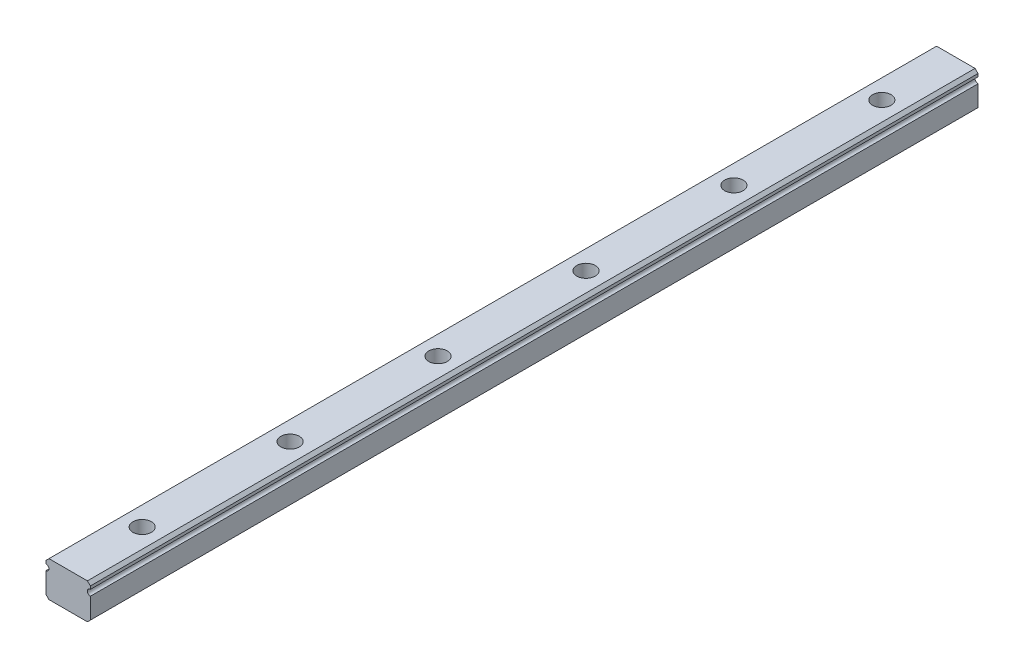
ISO-10303-21;
HEADER;
FILE_DESCRIPTION(('STEP AP214'),'2;1');
FILE_NAME('part.step','',(''),(''),'','','');
FILE_SCHEMA(('AUTOMOTIVE_DESIGN { 1 0 10303 214 1 1 1 1 }'));
ENDSEC;
DATA;
#1=APPLICATION_CONTEXT('core data for automotive mechanical design processes');
#2=APPLICATION_PROTOCOL_DEFINITION('international standard','automotive_design',2000,#1);
#3=PRODUCT_CONTEXT('',#1,'mechanical');
#4=PRODUCT('Part','Part','',(#3));
#5=PRODUCT_RELATED_PRODUCT_CATEGORY('part','',(#4));
#6=PRODUCT_DEFINITION_FORMATION('','',#4);
#7=PRODUCT_DEFINITION_CONTEXT('part definition',#1,'design');
#8=PRODUCT_DEFINITION('design','',#6,#7);
#9=PRODUCT_DEFINITION_SHAPE('','',#8);
#10=(LENGTH_UNIT() NAMED_UNIT(*) SI_UNIT(.MILLI.,.METRE.));
#11=(NAMED_UNIT(*) PLANE_ANGLE_UNIT() SI_UNIT($,.RADIAN.));
#12=(NAMED_UNIT(*) SI_UNIT($,.STERADIAN.) SOLID_ANGLE_UNIT());
#13=UNCERTAINTY_MEASURE_WITH_UNIT(LENGTH_MEASURE(1.E-05),#10,'distance_accuracy_value','');
#14=(GEOMETRIC_REPRESENTATION_CONTEXT(3) GLOBAL_UNCERTAINTY_ASSIGNED_CONTEXT((#13)) GLOBAL_UNIT_ASSIGNED_CONTEXT((#10,
#11,#12)) REPRESENTATION_CONTEXT('',''));
#15=CARTESIAN_POINT('',(0.,0.,0.));
#16=DIRECTION('',(0.,0.,1.));
#17=DIRECTION('',(1.,0.,0.));
#18=AXIS2_PLACEMENT_3D('',#15,#16,#17);
#19=CARTESIAN_POINT('',(0.,1.2,55.));
#20=DIRECTION('',(0.,1.,0.));
#21=DIRECTION('',(0.,0.,1.));
#22=AXIS2_PLACEMENT_3D('',#19,#20,#21);
#23=CYLINDRICAL_SURFACE('',#22,0.624999999999999);
#24=CARTESIAN_POINT('',(0.,-1.2,55.));
#25=DIRECTION('',(0.,1.,0.));
#26=DIRECTION('',(-1.,0.,0.));
#27=AXIS2_PLACEMENT_3D('',#24,#25,#26);
#28=CIRCLE('',#27,0.624999999999999);
#29=CARTESIAN_POINT('',(-0.624999999999999,-1.2,55.));
#30=VERTEX_POINT('',#29);
#31=EDGE_CURVE('E45',#30,#30,#28,.T.);
#32=ORIENTED_EDGE('',*,*,#31,.F.);
#33=EDGE_LOOP('',(#32));
#34=FACE_BOUND('',#33,.T.);
#35=CARTESIAN_POINT('',(0.,1.2,55.));
#36=DIRECTION('',(0.,1.,0.));
#37=DIRECTION('',(0.,0.,1.));
#38=AXIS2_PLACEMENT_3D('',#35,#36,#37);
#39=CIRCLE('',#38,0.624999999999998);
#40=CARTESIAN_POINT('',(0.,1.2,55.625));
#41=VERTEX_POINT('',#40);
#42=EDGE_CURVE('E11',#41,#41,#39,.T.);
#43=ORIENTED_EDGE('',*,*,#42,.T.);
#44=EDGE_LOOP('',(#43));
#45=FACE_BOUND('',#44,.T.);
#46=ADVANCED_FACE('F37',(#34,#45),#23,.F.);
#47=CARTESIAN_POINT('',(0.,1.2,45.));
#48=DIRECTION('',(0.,1.,0.));
#49=DIRECTION('',(0.,0.,1.));
#50=AXIS2_PLACEMENT_3D('',#47,#48,#49);
#51=CYLINDRICAL_SURFACE('',#50,0.624999999999999);
#52=CARTESIAN_POINT('',(0.,-1.2,45.));
#53=DIRECTION('',(0.,1.,0.));
#54=DIRECTION('',(-1.,0.,0.));
#55=AXIS2_PLACEMENT_3D('',#52,#53,#54);
#56=CIRCLE('',#55,0.624999999999999);
#57=CARTESIAN_POINT('',(-0.624999999999999,-1.2,45.));
#58=VERTEX_POINT('',#57);
#59=EDGE_CURVE('E221',#58,#58,#56,.T.);
#60=ORIENTED_EDGE('',*,*,#59,.F.);
#61=EDGE_LOOP('',(#60));
#62=FACE_BOUND('',#61,.T.);
#63=CARTESIAN_POINT('',(0.,1.2,45.));
#64=DIRECTION('',(0.,1.,0.));
#65=DIRECTION('',(0.,0.,1.));
#66=AXIS2_PLACEMENT_3D('',#63,#64,#65);
#67=CIRCLE('',#66,0.624999999999998);
#68=CARTESIAN_POINT('',(0.,1.2,45.625));
#69=VERTEX_POINT('',#68);
#70=EDGE_CURVE('E224',#69,#69,#67,.T.);
#71=ORIENTED_EDGE('',*,*,#70,.T.);
#72=EDGE_LOOP('',(#71));
#73=FACE_BOUND('',#72,.T.);
#74=ADVANCED_FACE('F233',(#62,#73),#51,.F.);
#75=CARTESIAN_POINT('',(0.,1.2,35.));
#76=DIRECTION('',(0.,1.,0.));
#77=DIRECTION('',(0.,0.,1.));
#78=AXIS2_PLACEMENT_3D('',#75,#76,#77);
#79=CYLINDRICAL_SURFACE('',#78,0.624999999999999);
#80=CARTESIAN_POINT('',(0.,-1.2,35.));
#81=DIRECTION('',(0.,1.,0.));
#82=DIRECTION('',(-1.,0.,0.));
#83=AXIS2_PLACEMENT_3D('',#80,#81,#82);
#84=CIRCLE('',#83,0.624999999999999);
#85=CARTESIAN_POINT('',(-0.624999999999999,-1.2,35.));
#86=VERTEX_POINT('',#85);
#87=EDGE_CURVE('E215',#86,#86,#84,.T.);
#88=ORIENTED_EDGE('',*,*,#87,.F.);
#89=EDGE_LOOP('',(#88));
#90=FACE_BOUND('',#89,.T.);
#91=CARTESIAN_POINT('',(0.,1.2,35.));
#92=DIRECTION('',(0.,1.,0.));
#93=DIRECTION('',(0.,0.,1.));
#94=AXIS2_PLACEMENT_3D('',#91,#92,#93);
#95=CIRCLE('',#94,0.624999999999998);
#96=CARTESIAN_POINT('',(0.,1.2,35.625));
#97=VERTEX_POINT('',#96);
#98=EDGE_CURVE('E218',#97,#97,#95,.T.);
#99=ORIENTED_EDGE('',*,*,#98,.T.);
#100=EDGE_LOOP('',(#99));
#101=FACE_BOUND('',#100,.T.);
#102=ADVANCED_FACE('F287',(#90,#101),#79,.F.);
#103=CARTESIAN_POINT('',(0.,1.2,25.));
#104=DIRECTION('',(0.,1.,0.));
#105=DIRECTION('',(0.,0.,1.));
#106=AXIS2_PLACEMENT_3D('',#103,#104,#105);
#107=CYLINDRICAL_SURFACE('',#106,0.624999999999999);
#108=CARTESIAN_POINT('',(0.,-1.2,25.));
#109=DIRECTION('',(0.,1.,0.));
#110=DIRECTION('',(-1.,0.,0.));
#111=AXIS2_PLACEMENT_3D('',#108,#109,#110);
#112=CIRCLE('',#111,0.624999999999999);
#113=CARTESIAN_POINT('',(-0.624999999999999,-1.2,25.));
#114=VERTEX_POINT('',#113);
#115=EDGE_CURVE('E209',#114,#114,#112,.T.);
#116=ORIENTED_EDGE('',*,*,#115,.F.);
#117=EDGE_LOOP('',(#116));
#118=FACE_BOUND('',#117,.T.);
#119=CARTESIAN_POINT('',(0.,1.2,25.));
#120=DIRECTION('',(0.,1.,0.));
#121=DIRECTION('',(0.,0.,1.));
#122=AXIS2_PLACEMENT_3D('',#119,#120,#121);
#123=CIRCLE('',#122,0.624999999999998);
#124=CARTESIAN_POINT('',(0.,1.2,25.625));
#125=VERTEX_POINT('',#124);
#126=EDGE_CURVE('E212',#125,#125,#123,.T.);
#127=ORIENTED_EDGE('',*,*,#126,.T.);
#128=EDGE_LOOP('',(#127));
#129=FACE_BOUND('',#128,.T.);
#130=ADVANCED_FACE('F283',(#118,#129),#107,.F.);
#131=CARTESIAN_POINT('',(-1.5,0.799999999999999,60.));
#132=DIRECTION('',(1.,0.,0.));
#133=DIRECTION('',(0.,1.,0.));
#134=AXIS2_PLACEMENT_3D('',#131,#132,#133);
#135=PLANE('',#134);
#136=DIRECTION('',(0.,-1.,0.));
#137=VECTOR('',#136,1.);
#138=CARTESIAN_POINT('',(-1.5,0.799999999999999,0.));
#139=LINE('',#138,#137);
#140=CARTESIAN_POINT('',(-1.5,0.999999999999999,0.));
#141=VERTEX_POINT('',#140);
#142=CARTESIAN_POINT('',(-1.5,0.799999999999999,0.));
#143=VERTEX_POINT('',#142);
#144=EDGE_CURVE('E159',#141,#143,#139,.T.);
#145=ORIENTED_EDGE('',*,*,#144,.T.);
#146=DIRECTION('',(0.,0.,-1.));
#147=VECTOR('',#146,1.);
#148=CARTESIAN_POINT('',(-1.5,0.799999999999999,60.));
#149=LINE('',#148,#147);
#150=CARTESIAN_POINT('',(-1.5,0.799999999999999,60.));
#151=VERTEX_POINT('',#150);
#152=EDGE_CURVE('E207',#151,#143,#149,.T.);
#153=ORIENTED_EDGE('',*,*,#152,.F.);
#154=DIRECTION('',(0.,-1.,0.));
#155=VECTOR('',#154,1.);
#156=CARTESIAN_POINT('',(-1.5,0.799999999999999,60.));
#157=LINE('',#156,#155);
#158=CARTESIAN_POINT('',(-1.5,0.999999999999999,60.));
#159=VERTEX_POINT('',#158);
#160=EDGE_CURVE('E182',#159,#151,#157,.T.);
#161=ORIENTED_EDGE('',*,*,#160,.F.);
#162=DIRECTION('',(0.,0.,-1.));
#163=VECTOR('',#162,1.);
#164=CARTESIAN_POINT('',(-1.5,0.999999999999999,60.));
#165=LINE('',#164,#163);
#166=EDGE_CURVE('E155',#159,#141,#165,.T.);
#167=ORIENTED_EDGE('',*,*,#166,.T.);
#168=EDGE_LOOP('',(#145,#153,#161,#167));
#169=FACE_BOUND('',#168,.T.);
#170=ADVANCED_FACE('F280',(#169),#135,.F.);
#171=CARTESIAN_POINT('',(-1.5,0.6,60.));
#172=DIRECTION('',(0.,0.,-1.));
#173=DIRECTION('',(-1.,0.,0.));
#174=AXIS2_PLACEMENT_3D('',#171,#172,#173);
#175=CYLINDRICAL_SURFACE('',#174,0.2);
#176=CARTESIAN_POINT('',(-1.5,0.6,0.));
#177=DIRECTION('',(0.,0.,-1.));
#178=DIRECTION('',(1.,0.,0.));
#179=AXIS2_PLACEMENT_3D('',#176,#177,#178);
#180=CIRCLE('',#179,0.2);
#181=CARTESIAN_POINT('',(-1.5,0.4,0.));
#182=VERTEX_POINT('',#181);
#183=EDGE_CURVE('E162',#143,#182,#180,.T.);
#184=ORIENTED_EDGE('',*,*,#183,.T.);
#185=DIRECTION('',(0.,0.,-1.));
#186=VECTOR('',#185,1.);
#187=CARTESIAN_POINT('',(-1.5,0.4,60.));
#188=LINE('',#187,#186);
#189=CARTESIAN_POINT('',(-1.5,0.4,60.));
#190=VERTEX_POINT('',#189);
#191=EDGE_CURVE('E204',#190,#182,#188,.T.);
#192=ORIENTED_EDGE('',*,*,#191,.F.);
#193=CARTESIAN_POINT('',(-1.5,0.6,60.));
#194=DIRECTION('',(0.,0.,-1.));
#195=DIRECTION('',(1.,0.,0.));
#196=AXIS2_PLACEMENT_3D('',#193,#194,#195);
#197=CIRCLE('',#196,0.2);
#198=EDGE_CURVE('E109',#151,#190,#197,.T.);
#199=ORIENTED_EDGE('',*,*,#198,.F.);
#200=ORIENTED_EDGE('',*,*,#152,.T.);
#201=EDGE_LOOP('',(#184,#192,#199,#200));
#202=FACE_BOUND('',#201,.T.);
#203=ADVANCED_FACE('F276',(#202),#175,.F.);
#204=CARTESIAN_POINT('',(-1.5,-1.,60.));
#205=DIRECTION('',(1.,0.,0.));
#206=DIRECTION('',(0.,0.,-1.));
#207=AXIS2_PLACEMENT_3D('',#204,#205,#206);
#208=PLANE('',#207);
#209=DIRECTION('',(0.,-1.,0.));
#210=VECTOR('',#209,1.);
#211=CARTESIAN_POINT('',(-1.5,-1.,0.));
#212=LINE('',#211,#210);
#213=CARTESIAN_POINT('',(-1.5,-1.,0.));
#214=VERTEX_POINT('',#213);
#215=EDGE_CURVE('E165',#182,#214,#212,.T.);
#216=ORIENTED_EDGE('',*,*,#215,.T.);
#217=DIRECTION('',(0.,0.,-1.));
#218=VECTOR('',#217,1.);
#219=CARTESIAN_POINT('',(-1.5,-1.,60.));
#220=LINE('',#219,#218);
#221=CARTESIAN_POINT('',(-1.5,-1.,60.));
#222=VERTEX_POINT('',#221);
#223=EDGE_CURVE('E201',#222,#214,#220,.T.);
#224=ORIENTED_EDGE('',*,*,#223,.F.);
#225=DIRECTION('',(0.,-1.,0.));
#226=VECTOR('',#225,1.);
#227=CARTESIAN_POINT('',(-1.5,-1.,60.));
#228=LINE('',#227,#226);
#229=EDGE_CURVE('E464',#190,#222,#228,.T.);
#230=ORIENTED_EDGE('',*,*,#229,.F.);
#231=ORIENTED_EDGE('',*,*,#191,.T.);
#232=EDGE_LOOP('',(#216,#224,#230,#231));
#233=FACE_BOUND('',#232,.T.);
#234=ADVANCED_FACE('F272',(#233),#208,.F.);
#235=CARTESIAN_POINT('',(-1.5,-1.,60.));
#236=DIRECTION('',(0.707106781186549,0.707106781186546,0.));
#237=DIRECTION('',(-0.707106781186546,0.707106781186549,0.));
#238=AXIS2_PLACEMENT_3D('',#235,#236,#237);
#239=PLANE('',#238);
#240=DIRECTION('',(0.707106781186546,-0.707106781186549,0.));
#241=VECTOR('',#240,1.);
#242=CARTESIAN_POINT('',(-1.5,-1.,0.));
#243=LINE('',#242,#241);
#244=CARTESIAN_POINT('',(-1.3,-1.2,0.));
#245=VERTEX_POINT('',#244);
#246=EDGE_CURVE('E167',#214,#245,#243,.T.);
#247=ORIENTED_EDGE('',*,*,#246,.T.);
#248=DIRECTION('',(0.,0.,-1.));
#249=VECTOR('',#248,1.);
#250=CARTESIAN_POINT('',(-1.3,-1.2,60.));
#251=LINE('',#250,#249);
#252=CARTESIAN_POINT('',(-1.3,-1.2,60.));
#253=VERTEX_POINT('',#252);
#254=EDGE_CURVE('E198',#253,#245,#251,.T.);
#255=ORIENTED_EDGE('',*,*,#254,.F.);
#256=DIRECTION('',(0.707106781186546,-0.707106781186549,0.));
#257=VECTOR('',#256,1.);
#258=CARTESIAN_POINT('',(-1.5,-1.,60.));
#259=LINE('',#258,#257);
#260=EDGE_CURVE('E466',#222,#253,#259,.T.);
#261=ORIENTED_EDGE('',*,*,#260,.F.);
#262=ORIENTED_EDGE('',*,*,#223,.T.);
#263=EDGE_LOOP('',(#247,#255,#261,#262));
#264=FACE_BOUND('',#263,.T.);
#265=ADVANCED_FACE('F268',(#264),#239,.F.);
#266=CARTESIAN_POINT('',(-1.3,-1.2,60.));
#267=DIRECTION('',(0.,1.,0.));
#268=DIRECTION('',(-1.,0.,0.));
#269=AXIS2_PLACEMENT_3D('',#266,#267,#268);
#270=PLANE('',#269);
#271=CARTESIAN_POINT('',(0.,-1.2,15.));
#272=DIRECTION('',(0.,1.,0.));
#273=DIRECTION('',(-1.,0.,0.));
#274=AXIS2_PLACEMENT_3D('',#271,#272,#273);
#275=CIRCLE('',#274,0.624999999999999);
#276=CARTESIAN_POINT('',(-0.624999999999999,-1.2,15.));
#277=VERTEX_POINT('',#276);
#278=EDGE_CURVE('E451',#277,#277,#275,.T.);
#279=ORIENTED_EDGE('',*,*,#278,.T.);
#280=EDGE_LOOP('',(#279));
#281=FACE_BOUND('',#280,.T.);
#282=CARTESIAN_POINT('',(0.,-1.2,5.));
#283=DIRECTION('',(0.,1.,0.));
#284=DIRECTION('',(-1.,0.,0.));
#285=AXIS2_PLACEMENT_3D('',#282,#283,#284);
#286=CIRCLE('',#285,0.624999999999999);
#287=CARTESIAN_POINT('',(-0.624999999999999,-1.2,5.));
#288=VERTEX_POINT('',#287);
#289=EDGE_CURVE('E163',#288,#288,#286,.T.);
#290=ORIENTED_EDGE('',*,*,#289,.T.);
#291=EDGE_LOOP('',(#290));
#292=FACE_BOUND('',#291,.T.);
#293=DIRECTION('',(1.,0.,0.));
#294=VECTOR('',#293,1.);
#295=CARTESIAN_POINT('',(-1.3,-1.2,0.));
#296=LINE('',#295,#294);
#297=CARTESIAN_POINT('',(1.3,-1.2,0.));
#298=VERTEX_POINT('',#297);
#299=EDGE_CURVE('E169',#245,#298,#296,.T.);
#300=ORIENTED_EDGE('',*,*,#299,.T.);
#301=DIRECTION('',(0.,0.,-1.));
#302=VECTOR('',#301,1.);
#303=CARTESIAN_POINT('',(1.3,-1.2,60.));
#304=LINE('',#303,#302);
#305=CARTESIAN_POINT('',(1.3,-1.2,60.));
#306=VERTEX_POINT('',#305);
#307=EDGE_CURVE('E195',#306,#298,#304,.T.);
#308=ORIENTED_EDGE('',*,*,#307,.F.);
#309=DIRECTION('',(1.,0.,0.));
#310=VECTOR('',#309,1.);
#311=CARTESIAN_POINT('',(-1.3,-1.2,60.));
#312=LINE('',#311,#310);
#313=EDGE_CURVE('E468',#253,#306,#312,.T.);
#314=ORIENTED_EDGE('',*,*,#313,.F.);
#315=ORIENTED_EDGE('',*,*,#254,.T.);
#316=EDGE_LOOP('',(#300,#308,#314,#315));
#317=FACE_BOUND('',#316,.T.);
#318=ORIENTED_EDGE('',*,*,#115,.T.);
#319=EDGE_LOOP('',(#318));
#320=FACE_BOUND('',#319,.T.);
#321=ORIENTED_EDGE('',*,*,#87,.T.);
#322=EDGE_LOOP('',(#321));
#323=FACE_BOUND('',#322,.T.);
#324=ORIENTED_EDGE('',*,*,#59,.T.);
#325=EDGE_LOOP('',(#324));
#326=FACE_BOUND('',#325,.T.);
#327=ORIENTED_EDGE('',*,*,#31,.T.);
#328=EDGE_LOOP('',(#327));
#329=FACE_BOUND('',#328,.T.);
#330=ADVANCED_FACE('F229',(#281,#292,#317,#320,#323,#326,#329),#270,.F.);
#331=CARTESIAN_POINT('',(1.5,-1.,60.));
#332=DIRECTION('',(-0.707106781186548,0.707106781186547,0.));
#333=DIRECTION('',(-0.707106781186547,-0.707106781186548,0.));
#334=AXIS2_PLACEMENT_3D('',#331,#332,#333);
#335=PLANE('',#334);
#336=DIRECTION('',(0.707106781186547,0.707106781186548,0.));
#337=VECTOR('',#336,1.);
#338=CARTESIAN_POINT('',(1.5,-1.,0.));
#339=LINE('',#338,#337);
#340=CARTESIAN_POINT('',(1.5,-1.,0.));
#341=VERTEX_POINT('',#340);
#342=EDGE_CURVE('E171',#298,#341,#339,.T.);
#343=ORIENTED_EDGE('',*,*,#342,.T.);
#344=DIRECTION('',(0.,0.,-1.));
#345=VECTOR('',#344,1.);
#346=CARTESIAN_POINT('',(1.5,-1.,60.));
#347=LINE('',#346,#345);
#348=CARTESIAN_POINT('',(1.5,-1.,60.));
#349=VERTEX_POINT('',#348);
#350=EDGE_CURVE('E192',#349,#341,#347,.T.);
#351=ORIENTED_EDGE('',*,*,#350,.F.);
#352=DIRECTION('',(0.707106781186547,0.707106781186548,0.));
#353=VECTOR('',#352,1.);
#354=CARTESIAN_POINT('',(1.5,-1.,60.));
#355=LINE('',#354,#353);
#356=EDGE_CURVE('E470',#306,#349,#355,.T.);
#357=ORIENTED_EDGE('',*,*,#356,.F.);
#358=ORIENTED_EDGE('',*,*,#307,.T.);
#359=EDGE_LOOP('',(#343,#351,#357,#358));
#360=FACE_BOUND('',#359,.T.);
#361=ADVANCED_FACE('F261',(#360),#335,.F.);
#362=CARTESIAN_POINT('',(1.5,-1.,60.));
#363=DIRECTION('',(-1.,0.,0.));
#364=DIRECTION('',(0.,0.,1.));
#365=AXIS2_PLACEMENT_3D('',#362,#363,#364);
#366=PLANE('',#365);
#367=DIRECTION('',(0.,1.,0.));
#368=VECTOR('',#367,1.);
#369=CARTESIAN_POINT('',(1.5,-1.,0.));
#370=LINE('',#369,#368);
#371=CARTESIAN_POINT('',(1.5,0.4,0.));
#372=VERTEX_POINT('',#371);
#373=EDGE_CURVE('E173',#341,#372,#370,.T.);
#374=ORIENTED_EDGE('',*,*,#373,.T.);
#375=DIRECTION('',(0.,0.,-1.));
#376=VECTOR('',#375,1.);
#377=CARTESIAN_POINT('',(1.5,0.4,60.));
#378=LINE('',#377,#376);
#379=CARTESIAN_POINT('',(1.5,0.4,60.));
#380=VERTEX_POINT('',#379);
#381=EDGE_CURVE('E189',#380,#372,#378,.T.);
#382=ORIENTED_EDGE('',*,*,#381,.F.);
#383=DIRECTION('',(0.,1.,0.));
#384=VECTOR('',#383,1.);
#385=CARTESIAN_POINT('',(1.5,-1.,60.));
#386=LINE('',#385,#384);
#387=EDGE_CURVE('E472',#349,#380,#386,.T.);
#388=ORIENTED_EDGE('',*,*,#387,.F.);
#389=ORIENTED_EDGE('',*,*,#350,.T.);
#390=EDGE_LOOP('',(#374,#382,#388,#389));
#391=FACE_BOUND('',#390,.T.);
#392=ADVANCED_FACE('F257',(#391),#366,.F.);
#393=CARTESIAN_POINT('',(1.5,0.6,60.));
#394=DIRECTION('',(0.,0.,-1.));
#395=DIRECTION('',(-1.,0.,0.));
#396=AXIS2_PLACEMENT_3D('',#393,#394,#395);
#397=CYLINDRICAL_SURFACE('',#396,0.2);
#398=CARTESIAN_POINT('',(1.5,0.6,0.));
#399=DIRECTION('',(0.,0.,-1.));
#400=DIRECTION('',(-1.,0.,0.));
#401=AXIS2_PLACEMENT_3D('',#398,#399,#400);
#402=CIRCLE('',#401,0.2);
#403=CARTESIAN_POINT('',(1.5,0.799999999999999,0.));
#404=VERTEX_POINT('',#403);
#405=EDGE_CURVE('E175',#372,#404,#402,.T.);
#406=ORIENTED_EDGE('',*,*,#405,.T.);
#407=DIRECTION('',(0.,0.,-1.));
#408=VECTOR('',#407,1.);
#409=CARTESIAN_POINT('',(1.5,0.799999999999999,60.));
#410=LINE('',#409,#408);
#411=CARTESIAN_POINT('',(1.5,0.799999999999999,60.));
#412=VERTEX_POINT('',#411);
#413=EDGE_CURVE('E186',#412,#404,#410,.T.);
#414=ORIENTED_EDGE('',*,*,#413,.F.);
#415=CARTESIAN_POINT('',(1.5,0.6,60.));
#416=DIRECTION('',(0.,0.,-1.));
#417=DIRECTION('',(-1.,0.,0.));
#418=AXIS2_PLACEMENT_3D('',#415,#416,#417);
#419=CIRCLE('',#418,0.2);
#420=EDGE_CURVE('E474',#380,#412,#419,.T.);
#421=ORIENTED_EDGE('',*,*,#420,.F.);
#422=ORIENTED_EDGE('',*,*,#381,.T.);
#423=EDGE_LOOP('',(#406,#414,#421,#422));
#424=FACE_BOUND('',#423,.T.);
#425=ADVANCED_FACE('F253',(#424),#397,.F.);
#426=CARTESIAN_POINT('',(1.5,0.799999999999999,60.));
#427=DIRECTION('',(-1.,0.,0.));
#428=DIRECTION('',(0.,-1.,0.));
#429=AXIS2_PLACEMENT_3D('',#426,#427,#428);
#430=PLANE('',#429);
#431=DIRECTION('',(0.,1.,0.));
#432=VECTOR('',#431,1.);
#433=CARTESIAN_POINT('',(1.5,0.799999999999999,0.));
#434=LINE('',#433,#432);
#435=CARTESIAN_POINT('',(1.5,1.,0.));
#436=VERTEX_POINT('',#435);
#437=EDGE_CURVE('E177',#404,#436,#434,.T.);
#438=ORIENTED_EDGE('',*,*,#437,.T.);
#439=DIRECTION('',(0.,0.,-1.));
#440=VECTOR('',#439,1.);
#441=CARTESIAN_POINT('',(1.5,1.,60.));
#442=LINE('',#441,#440);
#443=CARTESIAN_POINT('',(1.5,1.,60.));
#444=VERTEX_POINT('',#443);
#445=EDGE_CURVE('E149',#444,#436,#442,.T.);
#446=ORIENTED_EDGE('',*,*,#445,.F.);
#447=DIRECTION('',(0.,1.,0.));
#448=VECTOR('',#447,1.);
#449=CARTESIAN_POINT('',(1.5,0.799999999999999,60.));
#450=LINE('',#449,#448);
#451=EDGE_CURVE('E140',#412,#444,#450,.T.);
#452=ORIENTED_EDGE('',*,*,#451,.F.);
#453=ORIENTED_EDGE('',*,*,#413,.T.);
#454=EDGE_LOOP('',(#438,#446,#452,#453));
#455=FACE_BOUND('',#454,.T.);
#456=ADVANCED_FACE('F245',(#455),#430,.F.);
#457=CARTESIAN_POINT('',(1.5,1.,60.));
#458=DIRECTION('',(-0.707106781186548,-0.707106781186547,0.));
#459=DIRECTION('',(0.707106781186547,-0.707106781186548,0.));
#460=AXIS2_PLACEMENT_3D('',#457,#458,#459);
#461=PLANE('',#460);
#462=DIRECTION('',(-0.707106781186547,0.707106781186548,0.));
#463=VECTOR('',#462,1.);
#464=CARTESIAN_POINT('',(1.5,1.,0.));
#465=LINE('',#464,#463);
#466=CARTESIAN_POINT('',(1.3,1.2,0.));
#467=VERTEX_POINT('',#466);
#468=EDGE_CURVE('E148',#436,#467,#465,.T.);
#469=ORIENTED_EDGE('',*,*,#468,.T.);
#470=DIRECTION('',(0.,0.,-1.));
#471=VECTOR('',#470,1.);
#472=CARTESIAN_POINT('',(1.3,1.2,60.));
#473=LINE('',#472,#471);
#474=CARTESIAN_POINT('',(1.3,1.2,60.));
#475=VERTEX_POINT('',#474);
#476=EDGE_CURVE('E145',#475,#467,#473,.T.);
#477=ORIENTED_EDGE('',*,*,#476,.F.);
#478=DIRECTION('',(-0.707106781186547,0.707106781186548,0.));
#479=VECTOR('',#478,1.);
#480=CARTESIAN_POINT('',(1.5,1.,60.));
#481=LINE('',#480,#479);
#482=EDGE_CURVE('E134',#444,#475,#481,.T.);
#483=ORIENTED_EDGE('',*,*,#482,.F.);
#484=ORIENTED_EDGE('',*,*,#445,.T.);
#485=EDGE_LOOP('',(#469,#477,#483,#484));
#486=FACE_BOUND('',#485,.T.);
#487=ADVANCED_FACE('F146',(#486),#461,.F.);
#488=CARTESIAN_POINT('',(-1.3,1.2,60.));
#489=DIRECTION('',(0.,-1.,0.));
#490=DIRECTION('',(0.,0.,-1.));
#491=AXIS2_PLACEMENT_3D('',#488,#489,#490);
#492=PLANE('',#491);
#493=CARTESIAN_POINT('',(0.,1.2,15.));
#494=DIRECTION('',(0.,1.,0.));
#495=DIRECTION('',(0.,0.,1.));
#496=AXIS2_PLACEMENT_3D('',#493,#494,#495);
#497=CIRCLE('',#496,0.624999999999998);
#498=CARTESIAN_POINT('',(0.,1.2,15.625));
#499=VERTEX_POINT('',#498);
#500=EDGE_CURVE('E453',#499,#499,#497,.T.);
#501=ORIENTED_EDGE('',*,*,#500,.F.);
#502=EDGE_LOOP('',(#501));
#503=FACE_BOUND('',#502,.T.);
#504=CARTESIAN_POINT('',(0.,1.2,5.));
#505=DIRECTION('',(0.,1.,0.));
#506=DIRECTION('',(0.,0.,1.));
#507=AXIS2_PLACEMENT_3D('',#504,#505,#506);
#508=CIRCLE('',#507,0.624999999999998);
#509=CARTESIAN_POINT('',(0.,1.2,5.625));
#510=VERTEX_POINT('',#509);
#511=EDGE_CURVE('E454',#510,#510,#508,.T.);
#512=ORIENTED_EDGE('',*,*,#511,.F.);
#513=EDGE_LOOP('',(#512));
#514=FACE_BOUND('',#513,.T.);
#515=DIRECTION('',(-1.,0.,0.));
#516=VECTOR('',#515,1.);
#517=CARTESIAN_POINT('',(-1.3,1.2,0.));
#518=LINE('',#517,#516);
#519=CARTESIAN_POINT('',(-1.3,1.2,0.));
#520=VERTEX_POINT('',#519);
#521=EDGE_CURVE('E94',#467,#520,#518,.T.);
#522=ORIENTED_EDGE('',*,*,#521,.T.);
#523=DIRECTION('',(0.,0.,-1.));
#524=VECTOR('',#523,1.);
#525=CARTESIAN_POINT('',(-1.3,1.2,60.));
#526=LINE('',#525,#524);
#527=CARTESIAN_POINT('',(-1.3,1.2,60.));
#528=VERTEX_POINT('',#527);
#529=EDGE_CURVE('E150',#528,#520,#526,.T.);
#530=ORIENTED_EDGE('',*,*,#529,.F.);
#531=DIRECTION('',(-1.,0.,0.));
#532=VECTOR('',#531,1.);
#533=CARTESIAN_POINT('',(-1.3,1.2,60.));
#534=LINE('',#533,#532);
#535=EDGE_CURVE('E138',#475,#528,#534,.T.);
#536=ORIENTED_EDGE('',*,*,#535,.F.);
#537=ORIENTED_EDGE('',*,*,#476,.T.);
#538=EDGE_LOOP('',(#522,#530,#536,#537));
#539=FACE_BOUND('',#538,.T.);
#540=ORIENTED_EDGE('',*,*,#126,.F.);
#541=EDGE_LOOP('',(#540));
#542=FACE_BOUND('',#541,.T.);
#543=ORIENTED_EDGE('',*,*,#98,.F.);
#544=EDGE_LOOP('',(#543));
#545=FACE_BOUND('',#544,.T.);
#546=ORIENTED_EDGE('',*,*,#70,.F.);
#547=EDGE_LOOP('',(#546));
#548=FACE_BOUND('',#547,.T.);
#549=ORIENTED_EDGE('',*,*,#42,.F.);
#550=EDGE_LOOP('',(#549));
#551=FACE_BOUND('',#550,.T.);
#552=ADVANCED_FACE('F152',(#503,#514,#539,#542,#545,#548,#551),#492,.F.);
#553=CARTESIAN_POINT('',(-1.5,0.999999999999999,60.));
#554=DIRECTION('',(0.707106781186549,-0.707106781186546,0.));
#555=DIRECTION('',(0.707106781186546,0.707106781186549,0.));
#556=AXIS2_PLACEMENT_3D('',#553,#554,#555);
#557=PLANE('',#556);
#558=DIRECTION('',(-0.707106781186546,-0.707106781186549,0.));
#559=VECTOR('',#558,1.);
#560=CARTESIAN_POINT('',(-1.5,0.999999999999999,0.));
#561=LINE('',#560,#559);
#562=EDGE_CURVE('E100',#520,#141,#561,.T.);
#563=ORIENTED_EDGE('',*,*,#562,.T.);
#564=ORIENTED_EDGE('',*,*,#166,.F.);
#565=DIRECTION('',(-0.707106781186546,-0.707106781186549,0.));
#566=VECTOR('',#565,1.);
#567=CARTESIAN_POINT('',(-1.5,0.999999999999999,60.));
#568=LINE('',#567,#566);
#569=EDGE_CURVE('E53',#528,#159,#568,.T.);
#570=ORIENTED_EDGE('',*,*,#569,.F.);
#571=ORIENTED_EDGE('',*,*,#529,.T.);
#572=EDGE_LOOP('',(#563,#564,#570,#571));
#573=FACE_BOUND('',#572,.T.);
#574=ADVANCED_FACE('F237',(#573),#557,.F.);
#575=CARTESIAN_POINT('',(1.5,0.6,60.));
#576=DIRECTION('',(0.,0.,-1.));
#577=DIRECTION('',(-1.,0.,0.));
#578=AXIS2_PLACEMENT_3D('',#575,#576,#577);
#579=PLANE('',#578);
#580=ORIENTED_EDGE('',*,*,#160,.T.);
#581=ORIENTED_EDGE('',*,*,#198,.T.);
#582=ORIENTED_EDGE('',*,*,#229,.T.);
#583=ORIENTED_EDGE('',*,*,#260,.T.);
#584=ORIENTED_EDGE('',*,*,#313,.T.);
#585=ORIENTED_EDGE('',*,*,#356,.T.);
#586=ORIENTED_EDGE('',*,*,#387,.T.);
#587=ORIENTED_EDGE('',*,*,#420,.T.);
#588=ORIENTED_EDGE('',*,*,#451,.T.);
#589=ORIENTED_EDGE('',*,*,#482,.T.);
#590=ORIENTED_EDGE('',*,*,#535,.T.);
#591=ORIENTED_EDGE('',*,*,#569,.T.);
#592=EDGE_LOOP('',(#580,#581,#582,#583,#584,#585,#586,#587,#588,#589,#590,#591));
#593=FACE_BOUND('',#592,.T.);
#594=ADVANCED_FACE('F136',(#593),#579,.F.);
#595=CARTESIAN_POINT('',(1.5,0.6,0.));
#596=DIRECTION('',(0.,0.,-1.));
#597=DIRECTION('',(-1.,0.,0.));
#598=AXIS2_PLACEMENT_3D('',#595,#596,#597);
#599=PLANE('',#598);
#600=ORIENTED_EDGE('',*,*,#144,.F.);
#601=ORIENTED_EDGE('',*,*,#562,.F.);
#602=ORIENTED_EDGE('',*,*,#521,.F.);
#603=ORIENTED_EDGE('',*,*,#468,.F.);
#604=ORIENTED_EDGE('',*,*,#437,.F.);
#605=ORIENTED_EDGE('',*,*,#405,.F.);
#606=ORIENTED_EDGE('',*,*,#373,.F.);
#607=ORIENTED_EDGE('',*,*,#342,.F.);
#608=ORIENTED_EDGE('',*,*,#299,.F.);
#609=ORIENTED_EDGE('',*,*,#246,.F.);
#610=ORIENTED_EDGE('',*,*,#215,.F.);
#611=ORIENTED_EDGE('',*,*,#183,.F.);
#612=EDGE_LOOP('',(#600,#601,#602,#603,#604,#605,#606,#607,#608,#609,#610,#611));
#613=FACE_BOUND('',#612,.T.);
#614=ADVANCED_FACE('F369',(#613),#599,.T.);
#615=CARTESIAN_POINT('',(0.,1.2,5.));
#616=DIRECTION('',(0.,1.,0.));
#617=DIRECTION('',(0.,0.,1.));
#618=AXIS2_PLACEMENT_3D('',#615,#616,#617);
#619=CYLINDRICAL_SURFACE('',#618,0.624999999999999);
#620=ORIENTED_EDGE('',*,*,#289,.F.);
#621=EDGE_LOOP('',(#620));
#622=FACE_BOUND('',#621,.T.);
#623=ORIENTED_EDGE('',*,*,#511,.T.);
#624=EDGE_LOOP('',(#623));
#625=FACE_BOUND('',#624,.T.);
#626=ADVANCED_FACE('F378',(#622,#625),#619,.F.);
#627=CARTESIAN_POINT('',(0.,1.2,15.));
#628=DIRECTION('',(0.,1.,0.));
#629=DIRECTION('',(0.,0.,1.));
#630=AXIS2_PLACEMENT_3D('',#627,#628,#629);
#631=CYLINDRICAL_SURFACE('',#630,0.624999999999999);
#632=ORIENTED_EDGE('',*,*,#278,.F.);
#633=EDGE_LOOP('',(#632));
#634=FACE_BOUND('',#633,.T.);
#635=ORIENTED_EDGE('',*,*,#500,.T.);
#636=EDGE_LOOP('',(#635));
#637=FACE_BOUND('',#636,.T.);
#638=ADVANCED_FACE('F388',(#634,#637),#631,.F.);
#639=CLOSED_SHELL('',(#46,#74,#102,#130,#170,#203,#234,#265,#330,#361,#392,#425,#456,#487,#552,
#574,#594,#614,#626,#638));
#640=MANIFOLD_SOLID_BREP('B2',#639);
#641=ADVANCED_BREP_SHAPE_REPRESENTATION('',(#18,#640),#14);
#642=SHAPE_DEFINITION_REPRESENTATION(#9,#641);
ENDSEC;
END-ISO-10303-21;
